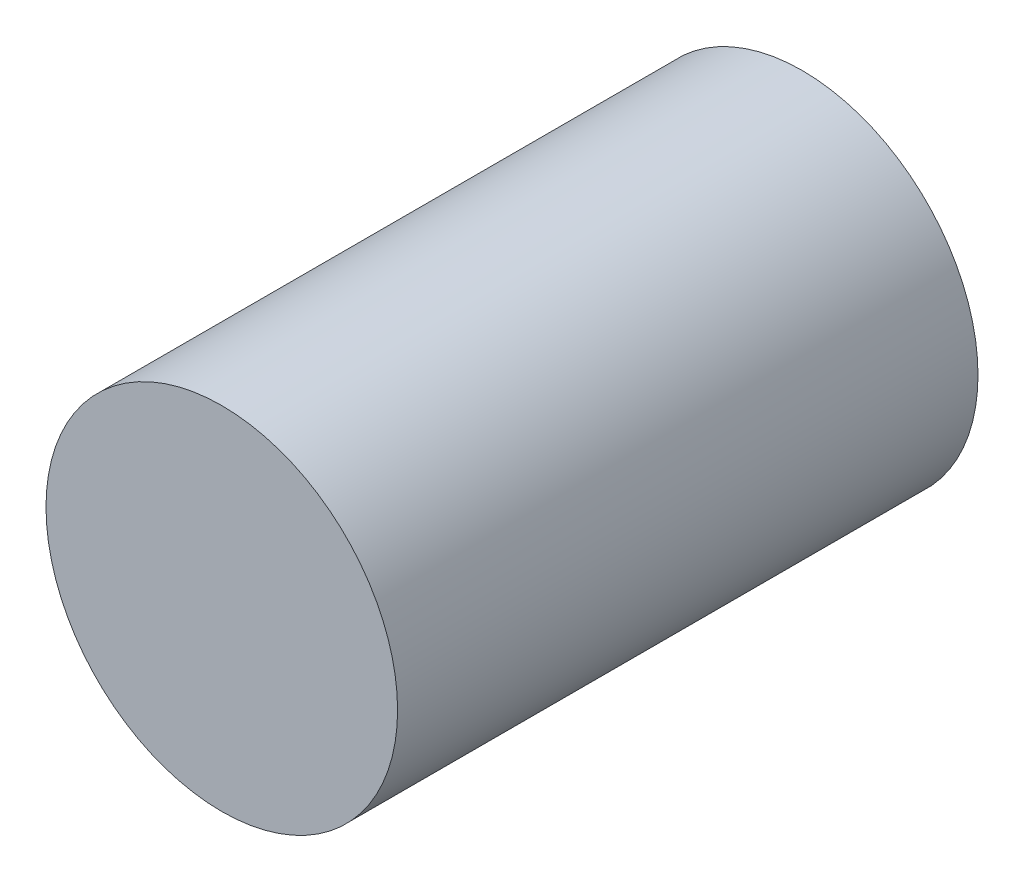
ISO-10303-21;
HEADER;
FILE_DESCRIPTION(('STEP AP214'),'2;1');
FILE_NAME('part.step','',(''),(''),'','','');
FILE_SCHEMA(('AUTOMOTIVE_DESIGN { 1 0 10303 214 1 1 1 1 }'));
ENDSEC;
DATA;
#1=APPLICATION_CONTEXT('core data for automotive mechanical design processes');
#2=APPLICATION_PROTOCOL_DEFINITION('international standard','automotive_design',2000,#1);
#3=PRODUCT_CONTEXT('',#1,'mechanical');
#4=PRODUCT('Part','Part','',(#3));
#5=PRODUCT_RELATED_PRODUCT_CATEGORY('part','',(#4));
#6=PRODUCT_DEFINITION_FORMATION('','',#4);
#7=PRODUCT_DEFINITION_CONTEXT('part definition',#1,'design');
#8=PRODUCT_DEFINITION('design','',#6,#7);
#9=PRODUCT_DEFINITION_SHAPE('','',#8);
#10=(LENGTH_UNIT() NAMED_UNIT(*) SI_UNIT(.MILLI.,.METRE.));
#11=(NAMED_UNIT(*) PLANE_ANGLE_UNIT() SI_UNIT($,.RADIAN.));
#12=(NAMED_UNIT(*) SI_UNIT($,.STERADIAN.) SOLID_ANGLE_UNIT());
#13=UNCERTAINTY_MEASURE_WITH_UNIT(LENGTH_MEASURE(1.E-05),#10,'distance_accuracy_value','');
#14=(GEOMETRIC_REPRESENTATION_CONTEXT(3) GLOBAL_UNCERTAINTY_ASSIGNED_CONTEXT((#13)) GLOBAL_UNIT_ASSIGNED_CONTEXT((#10,
#11,#12)) REPRESENTATION_CONTEXT('',''));
#15=CARTESIAN_POINT('',(0.,0.,0.));
#16=DIRECTION('',(0.,0.,1.));
#17=DIRECTION('',(1.,0.,0.));
#18=AXIS2_PLACEMENT_3D('',#15,#16,#17);
#19=CARTESIAN_POINT('',(0.,0.,3.3));
#20=DIRECTION('',(0.,0.,-1.));
#21=DIRECTION('',(-1.,0.,0.));
#22=AXIS2_PLACEMENT_3D('',#19,#20,#21);
#23=CYLINDRICAL_SURFACE('',#22,0.999500000000001);
#24=CARTESIAN_POINT('',(0.,0.,3.3));
#25=DIRECTION('',(0.,0.,1.));
#26=DIRECTION('',(1.,0.,0.));
#27=AXIS2_PLACEMENT_3D('',#24,#25,#26);
#28=CIRCLE('',#27,0.999500000000001);
#29=CARTESIAN_POINT('',(0.999500000000001,0.,3.3));
#30=VERTEX_POINT('',#29);
#31=EDGE_CURVE('E10',#30,#30,#28,.T.);
#32=ORIENTED_EDGE('',*,*,#31,.F.);
#33=EDGE_LOOP('',(#32));
#34=FACE_BOUND('',#33,.T.);
#35=CARTESIAN_POINT('',(0.,0.,0.));
#36=DIRECTION('',(0.,0.,1.));
#37=DIRECTION('',(1.,0.,0.));
#38=AXIS2_PLACEMENT_3D('',#35,#36,#37);
#39=CIRCLE('',#38,0.999500000000001);
#40=CARTESIAN_POINT('',(0.999500000000001,0.,0.));
#41=VERTEX_POINT('',#40);
#42=EDGE_CURVE('E33',#41,#41,#39,.T.);
#43=ORIENTED_EDGE('',*,*,#42,.T.);
#44=EDGE_LOOP('',(#43));
#45=FACE_BOUND('',#44,.T.);
#46=ADVANCED_FACE('F30',(#34,#45),#23,.T.);
#47=CARTESIAN_POINT('',(0.,0.,3.3));
#48=DIRECTION('',(0.,0.,1.));
#49=DIRECTION('',(1.,0.,0.));
#50=AXIS2_PLACEMENT_3D('',#47,#48,#49);
#51=PLANE('',#50);
#52=ORIENTED_EDGE('',*,*,#31,.T.);
#53=EDGE_LOOP('',(#52));
#54=FACE_BOUND('',#53,.T.);
#55=ADVANCED_FACE('F45',(#54),#51,.T.);
#56=CARTESIAN_POINT('',(0.,0.,0.));
#57=DIRECTION('',(0.,0.,1.));
#58=DIRECTION('',(1.,0.,0.));
#59=AXIS2_PLACEMENT_3D('',#56,#57,#58);
#60=PLANE('',#59);
#61=ORIENTED_EDGE('',*,*,#42,.F.);
#62=EDGE_LOOP('',(#61));
#63=FACE_BOUND('',#62,.T.);
#64=ADVANCED_FACE('F43',(#63),#60,.F.);
#65=CLOSED_SHELL('',(#46,#55,#64));
#66=MANIFOLD_SOLID_BREP('B2',#65);
#67=ADVANCED_BREP_SHAPE_REPRESENTATION('',(#18,#66),#14);
#68=SHAPE_DEFINITION_REPRESENTATION(#9,#67);
ENDSEC;
END-ISO-10303-21;
